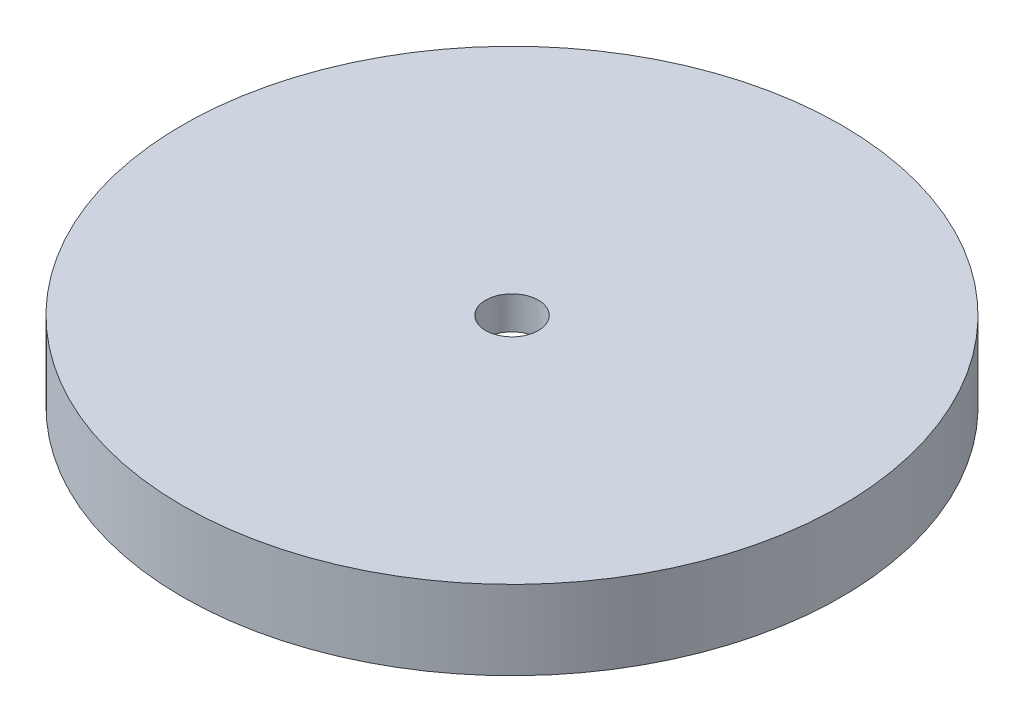
ISO-10303-21;
HEADER;
FILE_DESCRIPTION(('STEP AP214'),'2;1');
FILE_NAME('part.step','',(''),(''),'','','');
FILE_SCHEMA(('AUTOMOTIVE_DESIGN { 1 0 10303 214 1 1 1 1 }'));
ENDSEC;
DATA;
#1=APPLICATION_CONTEXT('core data for automotive mechanical design processes');
#2=APPLICATION_PROTOCOL_DEFINITION('international standard','automotive_design',2000,#1);
#3=PRODUCT_CONTEXT('',#1,'mechanical');
#4=PRODUCT('Part','Part','',(#3));
#5=PRODUCT_RELATED_PRODUCT_CATEGORY('part','',(#4));
#6=PRODUCT_DEFINITION_FORMATION('','',#4);
#7=PRODUCT_DEFINITION_CONTEXT('part definition',#1,'design');
#8=PRODUCT_DEFINITION('design','',#6,#7);
#9=PRODUCT_DEFINITION_SHAPE('','',#8);
#10=(LENGTH_UNIT() NAMED_UNIT(*) SI_UNIT(.MILLI.,.METRE.));
#11=(NAMED_UNIT(*) PLANE_ANGLE_UNIT() SI_UNIT($,.RADIAN.));
#12=(NAMED_UNIT(*) SI_UNIT($,.STERADIAN.) SOLID_ANGLE_UNIT());
#13=UNCERTAINTY_MEASURE_WITH_UNIT(LENGTH_MEASURE(1.E-05),#10,'distance_accuracy_value','');
#14=(GEOMETRIC_REPRESENTATION_CONTEXT(3) GLOBAL_UNCERTAINTY_ASSIGNED_CONTEXT((#13)) GLOBAL_UNIT_ASSIGNED_CONTEXT((#10,
#11,#12)) REPRESENTATION_CONTEXT('',''));
#15=CARTESIAN_POINT('',(0.,0.,0.));
#16=DIRECTION('',(0.,0.,1.));
#17=DIRECTION('',(1.,0.,0.));
#18=AXIS2_PLACEMENT_3D('',#15,#16,#17);
#19=CARTESIAN_POINT('',(0.,0.,0.));
#20=DIRECTION('',(0.,1.,0.));
#21=DIRECTION('',(0.,0.,1.));
#22=AXIS2_PLACEMENT_3D('',#19,#20,#21);
#23=PLANE('',#22);
#24=CARTESIAN_POINT('',(0.,0.,0.));
#25=DIRECTION('',(0.,1.,0.));
#26=DIRECTION('',(0.,0.,1.));
#27=AXIS2_PLACEMENT_3D('',#24,#25,#26);
#28=CIRCLE('',#27,50.);
#29=CARTESIAN_POINT('',(0.,0.,50.));
#30=VERTEX_POINT('',#29);
#31=EDGE_CURVE('E10',#30,#30,#28,.T.);
#32=ORIENTED_EDGE('',*,*,#31,.F.);
#33=EDGE_LOOP('',(#32));
#34=FACE_BOUND('',#33,.T.);
#35=CARTESIAN_POINT('',(0.,0.,0.));
#36=DIRECTION('',(0.,1.,0.));
#37=DIRECTION('',(0.,0.,1.));
#38=AXIS2_PLACEMENT_3D('',#35,#36,#37);
#39=CIRCLE('',#38,40.);
#40=CARTESIAN_POINT('',(0.,0.,40.));
#41=VERTEX_POINT('',#40);
#42=EDGE_CURVE('E38',#41,#41,#39,.T.);
#43=ORIENTED_EDGE('',*,*,#42,.T.);
#44=EDGE_LOOP('',(#43));
#45=FACE_BOUND('',#44,.T.);
#46=ADVANCED_FACE('F31',(#34,#45),#23,.F.);
#47=CARTESIAN_POINT('',(0.,7.,0.));
#48=DIRECTION('',(0.,-1.,0.));
#49=DIRECTION('',(0.,0.,-1.));
#50=AXIS2_PLACEMENT_3D('',#47,#48,#49);
#51=CYLINDRICAL_SURFACE('',#50,50.);
#52=ORIENTED_EDGE('',*,*,#31,.T.);
#53=EDGE_LOOP('',(#52));
#54=FACE_BOUND('',#53,.T.);
#55=CARTESIAN_POINT('',(0.,12.,0.));
#56=DIRECTION('',(0.,1.,0.));
#57=DIRECTION('',(0.,0.,1.));
#58=AXIS2_PLACEMENT_3D('',#55,#56,#57);
#59=CIRCLE('',#58,50.);
#60=CARTESIAN_POINT('',(0.,12.,50.));
#61=VERTEX_POINT('',#60);
#62=EDGE_CURVE('E46',#61,#61,#59,.T.);
#63=ORIENTED_EDGE('',*,*,#62,.F.);
#64=EDGE_LOOP('',(#63));
#65=FACE_BOUND('',#64,.T.);
#66=ADVANCED_FACE('F33',(#54,#65),#51,.T.);
#67=CARTESIAN_POINT('',(0.,7.,0.));
#68=DIRECTION('',(0.,-1.,0.));
#69=DIRECTION('',(0.,0.,-1.));
#70=AXIS2_PLACEMENT_3D('',#67,#68,#69);
#71=CYLINDRICAL_SURFACE('',#70,40.);
#72=CARTESIAN_POINT('',(0.,7.,0.));
#73=DIRECTION('',(0.,1.,0.));
#74=DIRECTION('',(0.,0.,1.));
#75=AXIS2_PLACEMENT_3D('',#72,#73,#74);
#76=CIRCLE('',#75,40.);
#77=CARTESIAN_POINT('',(0.,7.,40.));
#78=VERTEX_POINT('',#77);
#79=EDGE_CURVE('E42',#78,#78,#76,.T.);
#80=ORIENTED_EDGE('',*,*,#79,.T.);
#81=EDGE_LOOP('',(#80));
#82=FACE_BOUND('',#81,.T.);
#83=ORIENTED_EDGE('',*,*,#42,.F.);
#84=EDGE_LOOP('',(#83));
#85=FACE_BOUND('',#84,.T.);
#86=ADVANCED_FACE('F71',(#82,#85),#71,.F.);
#87=CARTESIAN_POINT('',(0.,7.,0.));
#88=DIRECTION('',(0.,1.,0.));
#89=DIRECTION('',(0.,0.,1.));
#90=AXIS2_PLACEMENT_3D('',#87,#88,#89);
#91=PLANE('',#90);
#92=CARTESIAN_POINT('',(0.,7.,0.));
#93=DIRECTION('',(0.,1.,0.));
#94=DIRECTION('',(0.,0.,1.));
#95=AXIS2_PLACEMENT_3D('',#92,#93,#94);
#96=CIRCLE('',#95,4.);
#97=CARTESIAN_POINT('',(0.,7.,4.));
#98=VERTEX_POINT('',#97);
#99=EDGE_CURVE('E52',#98,#98,#96,.T.);
#100=ORIENTED_EDGE('',*,*,#99,.T.);
#101=EDGE_LOOP('',(#100));
#102=FACE_BOUND('',#101,.T.);
#103=ORIENTED_EDGE('',*,*,#79,.F.);
#104=EDGE_LOOP('',(#103));
#105=FACE_BOUND('',#104,.T.);
#106=ADVANCED_FACE('F63',(#102,#105),#91,.F.);
#107=CARTESIAN_POINT('',(0.,12.,0.));
#108=DIRECTION('',(0.,1.,0.));
#109=DIRECTION('',(0.,0.,1.));
#110=AXIS2_PLACEMENT_3D('',#107,#108,#109);
#111=PLANE('',#110);
#112=ORIENTED_EDGE('',*,*,#62,.T.);
#113=EDGE_LOOP('',(#112));
#114=FACE_BOUND('',#113,.T.);
#115=CARTESIAN_POINT('',(0.,12.,0.));
#116=DIRECTION('',(0.,1.,0.));
#117=DIRECTION('',(0.,0.,1.));
#118=AXIS2_PLACEMENT_3D('',#115,#116,#117);
#119=CIRCLE('',#118,4.);
#120=CARTESIAN_POINT('',(0.,12.,4.));
#121=VERTEX_POINT('',#120);
#122=EDGE_CURVE('E51',#121,#121,#119,.T.);
#123=ORIENTED_EDGE('',*,*,#122,.F.);
#124=EDGE_LOOP('',(#123));
#125=FACE_BOUND('',#124,.T.);
#126=ADVANCED_FACE('F61',(#114,#125),#111,.T.);
#127=CARTESIAN_POINT('',(0.,12.,0.));
#128=DIRECTION('',(0.,-1.,0.));
#129=DIRECTION('',(0.,0.,-1.));
#130=AXIS2_PLACEMENT_3D('',#127,#128,#129);
#131=CYLINDRICAL_SURFACE('',#130,4.);
#132=ORIENTED_EDGE('',*,*,#122,.T.);
#133=EDGE_LOOP('',(#132));
#134=FACE_BOUND('',#133,.T.);
#135=ORIENTED_EDGE('',*,*,#99,.F.);
#136=EDGE_LOOP('',(#135));
#137=FACE_BOUND('',#136,.T.);
#138=ADVANCED_FACE('F58',(#134,#137),#131,.F.);
#139=CLOSED_SHELL('',(#46,#66,#86,#106,#126,#138));
#140=MANIFOLD_SOLID_BREP('B2',#139);
#141=ADVANCED_BREP_SHAPE_REPRESENTATION('',(#18,#140),#14);
#142=SHAPE_DEFINITION_REPRESENTATION(#9,#141);
ENDSEC;
END-ISO-10303-21;
